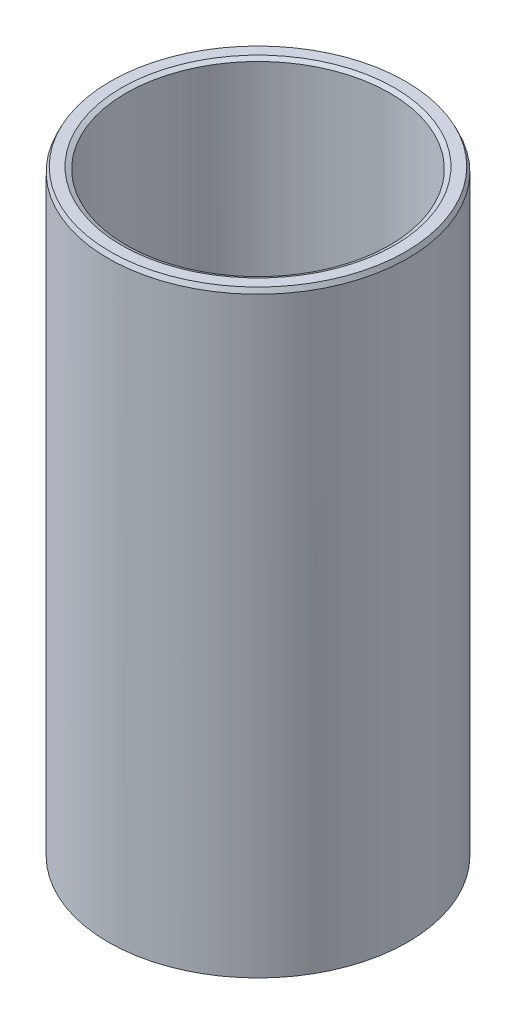
ISO-10303-21;
HEADER;
FILE_DESCRIPTION(('STEP AP214'),'2;1');
FILE_NAME('part.step','',(''),(''),'','','');
FILE_SCHEMA(('AUTOMOTIVE_DESIGN { 1 0 10303 214 1 1 1 1 }'));
ENDSEC;
DATA;
#1=APPLICATION_CONTEXT('core data for automotive mechanical design processes');
#2=APPLICATION_PROTOCOL_DEFINITION('international standard','automotive_design',2000,#1);
#3=PRODUCT_CONTEXT('',#1,'mechanical');
#4=PRODUCT('Part','Part','',(#3));
#5=PRODUCT_RELATED_PRODUCT_CATEGORY('part','',(#4));
#6=PRODUCT_DEFINITION_FORMATION('','',#4);
#7=PRODUCT_DEFINITION_CONTEXT('part definition',#1,'design');
#8=PRODUCT_DEFINITION('design','',#6,#7);
#9=PRODUCT_DEFINITION_SHAPE('','',#8);
#10=(LENGTH_UNIT() NAMED_UNIT(*) SI_UNIT(.MILLI.,.METRE.));
#11=(NAMED_UNIT(*) PLANE_ANGLE_UNIT() SI_UNIT($,.RADIAN.));
#12=(NAMED_UNIT(*) SI_UNIT($,.STERADIAN.) SOLID_ANGLE_UNIT());
#13=UNCERTAINTY_MEASURE_WITH_UNIT(LENGTH_MEASURE(1.E-05),#10,'distance_accuracy_value','');
#14=(GEOMETRIC_REPRESENTATION_CONTEXT(3) GLOBAL_UNCERTAINTY_ASSIGNED_CONTEXT((#13)) GLOBAL_UNIT_ASSIGNED_CONTEXT((#10,
#11,#12)) REPRESENTATION_CONTEXT('',''));
#15=CARTESIAN_POINT('',(0.,0.,0.));
#16=DIRECTION('',(0.,0.,1.));
#17=DIRECTION('',(1.,0.,0.));
#18=AXIS2_PLACEMENT_3D('',#15,#16,#17);
#19=CARTESIAN_POINT('',(0.,239.88289569676,0.));
#20=DIRECTION('',(0.,-1.,0.));
#21=DIRECTION('',(0.,0.,-1.));
#22=AXIS2_PLACEMENT_3D('',#19,#20,#21);
#23=CYLINDRICAL_SURFACE('',#22,60.);
#24=CARTESIAN_POINT('',(0.,0.880226060838596,0.));
#25=DIRECTION('',(0.,1.,0.));
#26=DIRECTION('',(0.,0.,1.));
#27=AXIS2_PLACEMENT_3D('',#24,#25,#26);
#28=CIRCLE('',#27,60.);
#29=CARTESIAN_POINT('',(0.,0.880226060838568,-60.));
#30=VERTEX_POINT('',#29);
#31=EDGE_CURVE('E10',#30,#30,#28,.T.);
#32=CARTESIAN_POINT('',(0.,238.010721630242,0.));
#33=DIRECTION('',(0.,1.,0.));
#34=DIRECTION('',(0.,0.,1.));
#35=AXIS2_PLACEMENT_3D('',#32,#33,#34);
#36=CIRCLE('',#35,60.);
#37=CARTESIAN_POINT('',(0.,238.010721630242,-60.));
#38=VERTEX_POINT('',#37);
#39=EDGE_CURVE('E50',#38,#38,#36,.F.);
#40=CARTESIAN_POINT('',(0.,0.880226060838568,-60.));
#41=CARTESIAN_POINT('',(0.,3.35033538968652,-60.));
#42=CARTESIAN_POINT('',(0.,5.82044471853446,-60.));
#43=CARTESIAN_POINT('',(0.,10.7606633762304,-60.));
#44=CARTESIAN_POINT('',(0.,13.2307727050783,-60.));
#45=CARTESIAN_POINT('',(0.,18.1709913627742,-60.));
#46=CARTESIAN_POINT('',(0.,20.6411006916221,-60.));
#47=CARTESIAN_POINT('',(0.,25.581319349318,-60.));
#48=CARTESIAN_POINT('',(0.,28.051428678166,-60.));
#49=CARTESIAN_POINT('',(0.,32.9916473358619,-60.));
#50=CARTESIAN_POINT('',(0.,35.4617566647099,-60.));
#51=CARTESIAN_POINT('',(0.,40.4019753224057,-60.));
#52=CARTESIAN_POINT('',(0.,42.8720846512537,-60.));
#53=CARTESIAN_POINT('',(0.,47.8123033089496,-60.));
#54=CARTESIAN_POINT('',(0.,50.2824126377975,-60.));
#55=CARTESIAN_POINT('',(0.,55.2226312954934,-60.));
#56=CARTESIAN_POINT('',(0.,57.6927406243414,-60.));
#57=CARTESIAN_POINT('',(0.,62.6329592820373,-60.));
#58=CARTESIAN_POINT('',(0.,65.1030686108852,-60.));
#59=CARTESIAN_POINT('',(0.,70.0432872685811,-60.));
#60=CARTESIAN_POINT('',(0.,72.5133965974291,-60.));
#61=CARTESIAN_POINT('',(0.,77.453615255125,-60.));
#62=CARTESIAN_POINT('',(0.,79.9237245839729,-60.));
#63=CARTESIAN_POINT('',(0.,84.8639432416688,-60.));
#64=CARTESIAN_POINT('',(0.,87.3340525705168,-60.));
#65=CARTESIAN_POINT('',(0.,92.2742712282127,-60.));
#66=CARTESIAN_POINT('',(0.,94.7443805570606,-60.));
#67=CARTESIAN_POINT('',(0.,99.6845992147565,-60.));
#68=CARTESIAN_POINT('',(0.,102.154708543604,-60.));
#69=CARTESIAN_POINT('',(0.,107.0949272013,-60.));
#70=CARTESIAN_POINT('',(0.,109.565036530148,-60.));
#71=CARTESIAN_POINT('',(0.,114.505255187844,-60.));
#72=CARTESIAN_POINT('',(0.,116.975364516692,-60.));
#73=CARTESIAN_POINT('',(0.,121.915583174388,-60.));
#74=CARTESIAN_POINT('',(0.,124.385692503236,-60.));
#75=CARTESIAN_POINT('',(0.,129.325911160932,-60.));
#76=CARTESIAN_POINT('',(0.,131.79602048978,-60.));
#77=CARTESIAN_POINT('',(0.,136.736239147476,-60.));
#78=CARTESIAN_POINT('',(0.,139.206348476324,-60.));
#79=CARTESIAN_POINT('',(0.,144.14656713402,-60.));
#80=CARTESIAN_POINT('',(0.,146.616676462868,-60.));
#81=CARTESIAN_POINT('',(0.,151.556895120563,-60.));
#82=CARTESIAN_POINT('',(0.,154.027004449411,-60.));
#83=CARTESIAN_POINT('',(0.,158.967223107107,-60.));
#84=CARTESIAN_POINT('',(0.,161.437332435955,-60.));
#85=CARTESIAN_POINT('',(0.,166.377551093651,-60.));
#86=CARTESIAN_POINT('',(0.,168.847660422499,-60.));
#87=CARTESIAN_POINT('',(0.,173.787879080195,-60.));
#88=CARTESIAN_POINT('',(0.,176.257988409043,-60.));
#89=CARTESIAN_POINT('',(0.,181.198207066739,-60.));
#90=CARTESIAN_POINT('',(0.,183.668316395587,-60.));
#91=CARTESIAN_POINT('',(0.,188.608535053283,-60.));
#92=CARTESIAN_POINT('',(0.,191.078644382131,-60.));
#93=CARTESIAN_POINT('',(0.,196.018863039826,-60.));
#94=CARTESIAN_POINT('',(0.,198.488972368674,-60.));
#95=CARTESIAN_POINT('',(0.,203.42919102637,-60.));
#96=CARTESIAN_POINT('',(0.,205.899300355218,-60.));
#97=CARTESIAN_POINT('',(0.,210.839519012914,-60.));
#98=CARTESIAN_POINT('',(0.,213.309628341762,-60.));
#99=CARTESIAN_POINT('',(0.,218.249846999458,-60.));
#100=CARTESIAN_POINT('',(0.,220.719956328306,-60.));
#101=CARTESIAN_POINT('',(0.,225.660174986002,-60.));
#102=CARTESIAN_POINT('',(0.,228.13028431485,-60.));
#103=CARTESIAN_POINT('',(0.,233.070502972546,-60.));
#104=CARTESIAN_POINT('',(0.,235.540612301394,-60.));
#105=CARTESIAN_POINT('',(0.,238.010721630242,-60.));
#106=B_SPLINE_CURVE_WITH_KNOTS('',3,(#40,#41,#42,#43,#44,#45,#46,#47,#48,#49,#50,#51,#52,#53,
#54,#55,#56,#57,#58,#59,#60,#61,#62,#63,#64,#65,#66,#67,#68,#69,#70,#71,#72,#73,#74,#75,#76,#77,
#78,#79,#80,#81,#82,#83,#84,#85,#86,#87,#88,#89,#90,#91,#92,#93,#94,#95,#96,#97,#98,#99,#100,
#101,#102,#103,#104,#105),.UNSPECIFIED.,.F.,.F.,(4,2,2,2,2,2,2,2,2,2,2,2,2,2,2,2,2,2,2,2,2,2,2,
2,2,2,2,2,2,2,2,2,4),(0.,7.41032798654384,14.8206559730877,22.2309839596315,29.6413119461754,
37.0516399327192,44.4619679192631,51.8722959058069,59.2826238923508,66.6929518788946,
74.1032798654385,81.5136078519823,88.9239358385261,96.33426382507,103.744591811614,
111.154919798158,118.565247784702,125.975575771245,133.385903757789,140.796231744333,
148.206559730877,155.616887717421,163.027215703965,170.437543690508,177.847871677052,
185.258199663596,192.66852765014,200.078855636684,207.489183623228,214.899511609772,
222.309839596315,229.720167582859,237.130495569403),.UNSPECIFIED.);
#107=EDGE_CURVE('BSEAM39',#30,#38,#106,.T.);
#108=ORIENTED_EDGE('',*,*,#31,.T.);
#109=ORIENTED_EDGE('',*,*,#39,.T.);
#110=ORIENTED_EDGE('',*,*,#107,.T.);
#111=ORIENTED_EDGE('',*,*,#107,.F.);
#112=EDGE_LOOP('',(#108,#110,#109,#111));
#113=FACE_BOUND('',#112,.T.);
#114=ADVANCED_FACE('F39',(#113),#23,.T.);
#115=CARTESIAN_POINT('',(0.,239.88289569676,0.));
#116=DIRECTION('',(0.,1.,0.));
#117=DIRECTION('',(0.,0.,1.));
#118=AXIS2_PLACEMENT_3D('',#115,#116,#117);
#119=PLANE('',#118);
#120=CARTESIAN_POINT('',(0.,239.88289569676,0.));
#121=DIRECTION('',(0.,1.,0.));
#122=DIRECTION('',(0.,0.,1.));
#123=AXIS2_PLACEMENT_3D('',#120,#121,#122);
#124=CIRCLE('',#123,54.6559119153576);
#125=CARTESIAN_POINT('',(0.,239.88289569676,54.6559119153576));
#126=VERTEX_POINT('',#125);
#127=EDGE_CURVE('E58',#126,#126,#124,.F.);
#128=ORIENTED_EDGE('',*,*,#127,.T.);
#129=EDGE_LOOP('',(#128));
#130=FACE_BOUND('',#129,.T.);
#131=CARTESIAN_POINT('',(0.,239.88289569676,0.));
#132=DIRECTION('',(0.,1.,0.));
#133=DIRECTION('',(0.,0.,1.));
#134=AXIS2_PLACEMENT_3D('',#131,#132,#133);
#135=CIRCLE('',#134,59.1197739391617);
#136=CARTESIAN_POINT('',(0.,239.88289569676,59.1197739391617));
#137=VERTEX_POINT('',#136);
#138=EDGE_CURVE('E61',#137,#137,#135,.T.);
#139=ORIENTED_EDGE('',*,*,#138,.T.);
#140=EDGE_LOOP('',(#139));
#141=FACE_BOUND('',#140,.T.);
#142=ADVANCED_FACE('F88',(#130,#141),#119,.T.);
#143=CARTESIAN_POINT('',(0.,0.,0.));
#144=DIRECTION('',(0.,1.,0.));
#145=DIRECTION('',(0.,0.,1.));
#146=AXIS2_PLACEMENT_3D('',#143,#144,#145);
#147=PLANE('',#146);
#148=CARTESIAN_POINT('',(0.,0.,0.));
#149=DIRECTION('',(0.,1.,0.));
#150=DIRECTION('',(0.,0.,1.));
#151=AXIS2_PLACEMENT_3D('',#148,#149,#150);
#152=CIRCLE('',#151,53.6639639096774);
#153=CARTESIAN_POINT('',(0.,0.,-53.6639639096774));
#154=VERTEX_POINT('',#153);
#155=EDGE_CURVE('E51',#154,#154,#152,.T.);
#156=ORIENTED_EDGE('',*,*,#155,.T.);
#157=EDGE_LOOP('',(#156));
#158=FACE_BOUND('',#157,.T.);
#159=CARTESIAN_POINT('',(0.,0.,0.));
#160=DIRECTION('',(0.,1.,0.));
#161=DIRECTION('',(0.,0.,1.));
#162=AXIS2_PLACEMENT_3D('',#159,#160,#161);
#163=CIRCLE('',#162,58.1278259334814);
#164=CARTESIAN_POINT('',(0.,0.,58.1278259334814));
#165=VERTEX_POINT('',#164);
#166=EDGE_CURVE('E54',#165,#165,#163,.F.);
#167=ORIENTED_EDGE('',*,*,#166,.T.);
#168=EDGE_LOOP('',(#167));
#169=FACE_BOUND('',#168,.T.);
#170=ADVANCED_FACE('F83',(#158,#169),#147,.F.);
#171=CARTESIAN_POINT('',(0.,239.88289569676,0.));
#172=DIRECTION('',(0.,-1.,0.));
#173=DIRECTION('',(0.,0.,-1.));
#174=AXIS2_PLACEMENT_3D('',#171,#172,#173);
#175=CYLINDRICAL_SURFACE('',#174,52.7837378488388);
#176=CARTESIAN_POINT('',(0.,239.002669635921,0.));
#177=DIRECTION('',(0.,1.,0.));
#178=DIRECTION('',(0.,0.,1.));
#179=AXIS2_PLACEMENT_3D('',#176,#177,#178);
#180=CIRCLE('',#179,52.7837378488388);
#181=CARTESIAN_POINT('',(0.,239.002669635921,-52.7837378488388));
#182=VERTEX_POINT('',#181);
#183=EDGE_CURVE('E67',#182,#182,#180,.T.);
#184=CARTESIAN_POINT('',(0.,1.87217406651852,0.));
#185=DIRECTION('',(0.,1.,0.));
#186=DIRECTION('',(0.,0.,1.));
#187=AXIS2_PLACEMENT_3D('',#184,#185,#186);
#188=CIRCLE('',#187,52.7837378488388);
#189=CARTESIAN_POINT('',(0.,1.87217406651849,-52.7837378488388));
#190=VERTEX_POINT('',#189);
#191=EDGE_CURVE('E69',#190,#190,#188,.F.);
#192=CARTESIAN_POINT('',(0.,239.002669635921,-52.7837378488388));
#193=CARTESIAN_POINT('',(0.,236.532560307073,-52.7837378488388));
#194=CARTESIAN_POINT('',(0.,234.062450978225,-52.7837378488388));
#195=CARTESIAN_POINT('',(0.,229.122232320529,-52.7837378488388));
#196=CARTESIAN_POINT('',(0.,226.652122991681,-52.7837378488388));
#197=CARTESIAN_POINT('',(0.,221.711904333985,-52.7837378488388));
#198=CARTESIAN_POINT('',(0.,219.241795005137,-52.7837378488388));
#199=CARTESIAN_POINT('',(0.,214.301576347441,-52.7837378488388));
#200=CARTESIAN_POINT('',(0.,211.831467018594,-52.7837378488388));
#201=CARTESIAN_POINT('',(0.,206.891248360898,-52.7837378488388));
#202=CARTESIAN_POINT('',(0.,204.42113903205,-52.7837378488388));
#203=CARTESIAN_POINT('',(0.,199.480920374354,-52.7837378488388));
#204=CARTESIAN_POINT('',(0.,197.010811045506,-52.7837378488388));
#205=CARTESIAN_POINT('',(0.,192.07059238781,-52.7837378488388));
#206=CARTESIAN_POINT('',(0.,189.600483058962,-52.7837378488388));
#207=CARTESIAN_POINT('',(0.,184.660264401266,-52.7837378488388));
#208=CARTESIAN_POINT('',(0.,182.190155072418,-52.7837378488388));
#209=CARTESIAN_POINT('',(0.,177.249936414722,-52.7837378488388));
#210=CARTESIAN_POINT('',(0.,174.779827085874,-52.7837378488388));
#211=CARTESIAN_POINT('',(0.,169.839608428179,-52.7837378488388));
#212=CARTESIAN_POINT('',(0.,167.369499099331,-52.7837378488388));
#213=CARTESIAN_POINT('',(0.,162.429280441635,-52.7837378488388));
#214=CARTESIAN_POINT('',(0.,159.959171112787,-52.7837378488388));
#215=CARTESIAN_POINT('',(0.,155.018952455091,-52.7837378488388));
#216=CARTESIAN_POINT('',(0.,152.548843126243,-52.7837378488388));
#217=CARTESIAN_POINT('',(0.,147.608624468547,-52.7837378488388));
#218=CARTESIAN_POINT('',(0.,145.138515139699,-52.7837378488388));
#219=CARTESIAN_POINT('',(0.,140.198296482003,-52.7837378488388));
#220=CARTESIAN_POINT('',(0.,137.728187153155,-52.7837378488388));
#221=CARTESIAN_POINT('',(0.,132.787968495459,-52.7837378488388));
#222=CARTESIAN_POINT('',(0.,130.317859166611,-52.7837378488388));
#223=CARTESIAN_POINT('',(0.,125.377640508916,-52.7837378488388));
#224=CARTESIAN_POINT('',(0.,122.907531180068,-52.7837378488388));
#225=CARTESIAN_POINT('',(0.,117.967312522372,-52.7837378488388));
#226=CARTESIAN_POINT('',(0.,115.497203193524,-52.7837378488388));
#227=CARTESIAN_POINT('',(0.,110.556984535828,-52.7837378488388));
#228=CARTESIAN_POINT('',(0.,108.08687520698,-52.7837378488388));
#229=CARTESIAN_POINT('',(0.,103.146656549284,-52.7837378488388));
#230=CARTESIAN_POINT('',(0.,100.676547220436,-52.7837378488388));
#231=CARTESIAN_POINT('',(0.,95.7363285627403,-52.7837378488388));
#232=CARTESIAN_POINT('',(0.,93.2662192338923,-52.7837378488388));
#233=CARTESIAN_POINT('',(0.,88.3260005761965,-52.7837378488388));
#234=CARTESIAN_POINT('',(0.,85.8558912473485,-52.7837378488388));
#235=CARTESIAN_POINT('',(0.,80.9156725896526,-52.7837378488388));
#236=CARTESIAN_POINT('',(0.,78.4455632608047,-52.7837378488388));
#237=CARTESIAN_POINT('',(0.,73.5053446031088,-52.7837378488388));
#238=CARTESIAN_POINT('',(0.,71.0352352742609,-52.7837378488388));
#239=CARTESIAN_POINT('',(0.,66.095016616565,-52.7837378488388));
#240=CARTESIAN_POINT('',(0.,63.624907287717,-52.7837378488388));
#241=CARTESIAN_POINT('',(0.,58.6846886300212,-52.7837378488388));
#242=CARTESIAN_POINT('',(0.,56.2145793011732,-52.7837378488388));
#243=CARTESIAN_POINT('',(0.,51.2743606434773,-52.7837378488388));
#244=CARTESIAN_POINT('',(0.,48.8042513146294,-52.7837378488388));
#245=CARTESIAN_POINT('',(0.,43.8640326569335,-52.7837378488388));
#246=CARTESIAN_POINT('',(0.,41.3939233280856,-52.7837378488388));
#247=CARTESIAN_POINT('',(0.,36.4537046703897,-52.7837378488388));
#248=CARTESIAN_POINT('',(0.,33.9835953415417,-52.7837378488388));
#249=CARTESIAN_POINT('',(0.,29.0433766838458,-52.7837378488388));
#250=CARTESIAN_POINT('',(0.,26.5732673549979,-52.7837378488388));
#251=CARTESIAN_POINT('',(0.,21.633048697302,-52.7837378488388));
#252=CARTESIAN_POINT('',(0.,19.1629393684541,-52.7837378488388));
#253=CARTESIAN_POINT('',(0.,14.2227207107582,-52.7837378488388));
#254=CARTESIAN_POINT('',(0.,11.7526113819102,-52.7837378488388));
#255=CARTESIAN_POINT('',(0.,6.81239272421436,-52.7837378488388));
#256=CARTESIAN_POINT('',(0.,4.34228339536643,-52.7837378488388));
#257=CARTESIAN_POINT('',(0.,1.87217406651849,-52.7837378488388));
#258=B_SPLINE_CURVE_WITH_KNOTS('',3,(#192,#193,#194,#195,#196,#197,#198,#199,#200,#201,#202,
#203,#204,#205,#206,#207,#208,#209,#210,#211,#212,#213,#214,#215,#216,#217,#218,#219,#220,#221,
#222,#223,#224,#225,#226,#227,#228,#229,#230,#231,#232,#233,#234,#235,#236,#237,#238,#239,#240,
#241,#242,#243,#244,#245,#246,#247,#248,#249,#250,#251,#252,#253,#254,#255,#256,#257),
.UNSPECIFIED.,.F.,.F.,(4,2,2,2,2,2,2,2,2,2,2,2,2,2,2,2,2,2,2,2,2,2,2,2,2,2,2,2,2,2,2,2,4),(0.,
7.41032798654381,14.8206559730876,22.2309839596315,29.6413119461753,37.0516399327191,
44.4619679192629,51.8722959058067,59.2826238923506,66.6929518788944,74.1032798654382,
81.5136078519821,88.9239358385259,96.3342638250697,103.744591811614,111.154919798157,
118.565247784701,125.975575771245,133.385903757789,140.796231744333,148.206559730876,
155.61688771742,163.027215703964,170.437543690508,177.847871677052,185.258199663596,
192.668527650139,200.078855636683,207.489183623227,214.899511609771,222.309839596315,
229.720167582859,237.130495569402),.UNSPECIFIED.);
#259=EDGE_CURVE('BSEAM71',#182,#190,#258,.T.);
#260=ORIENTED_EDGE('',*,*,#183,.T.);
#261=ORIENTED_EDGE('',*,*,#191,.T.);
#262=ORIENTED_EDGE('',*,*,#259,.T.);
#263=ORIENTED_EDGE('',*,*,#259,.F.);
#264=EDGE_LOOP('',(#260,#262,#261,#263));
#265=FACE_BOUND('',#264,.T.);
#266=ADVANCED_FACE('F71',(#265),#175,.F.);
#267=CARTESIAN_POINT('',(0.,239.002669635921,0.));
#268=DIRECTION('',(0.,1.,0.));
#269=DIRECTION('',(0.,0.,1.));
#270=AXIS2_PLACEMENT_3D('',#267,#268,#269);
#271=CONICAL_SURFACE('',#270,52.7837378488388,1.13130233999014);
#272=ORIENTED_EDGE('',*,*,#127,.F.);
#273=EDGE_LOOP('',(#272));
#274=FACE_BOUND('',#273,.T.);
#275=ORIENTED_EDGE('',*,*,#183,.F.);
#276=EDGE_LOOP('',(#275));
#277=FACE_BOUND('',#276,.T.);
#278=ADVANCED_FACE('F77',(#274,#277),#271,.F.);
#279=CARTESIAN_POINT('',(0.,0.,0.));
#280=DIRECTION('',(0.,-1.,0.));
#281=DIRECTION('',(0.,0.,-1.));
#282=AXIS2_PLACEMENT_3D('',#279,#280,#281);
#283=CONICAL_SURFACE('',#282,53.6639639096774,0.439493986804747);
#284=CARTESIAN_POINT('',(0.,1.87217406651852,-52.7837378488388));
#285=CARTESIAN_POINT('',(0.,1.85267225332561,-52.7929068703059));
#286=CARTESIAN_POINT('',(0.,1.83317044013271,-52.802075891773));
#287=CARTESIAN_POINT('',(0.,1.79416681374691,-52.8204139347071));
#288=CARTESIAN_POINT('',(0.,1.77466500055401,-52.8295829561742));
#289=CARTESIAN_POINT('',(0.,1.73566137416821,-52.8479209991083));
#290=CARTESIAN_POINT('',(0.,1.71615956097531,-52.8570900205754));
#291=CARTESIAN_POINT('',(0.,1.6771559345895,-52.8754280635095));
#292=CARTESIAN_POINT('',(0.,1.6576541213966,-52.8845970849766));
#293=CARTESIAN_POINT('',(0.,1.6186504950108,-52.9029351279107));
#294=CARTESIAN_POINT('',(0.,1.5991486818179,-52.9121041493778));
#295=CARTESIAN_POINT('',(0.,1.5601450554321,-52.9304421923119));
#296=CARTESIAN_POINT('',(0.,1.5406432422392,-52.939611213779));
#297=CARTESIAN_POINT('',(0.,1.50163961585339,-52.9579492567131));
#298=CARTESIAN_POINT('',(0.,1.48213780266049,-52.9671182781802));
#299=CARTESIAN_POINT('',(0.,1.44313417627469,-52.9854563211143));
#300=CARTESIAN_POINT('',(0.,1.42363236308179,-52.9946253425814));
#301=CARTESIAN_POINT('',(0.,1.38462873669599,-53.0129633855155));
#302=CARTESIAN_POINT('',(0.,1.36512692350309,-53.0221324069826));
#303=CARTESIAN_POINT('',(0.,1.32612329711728,-53.0404704499167));
#304=CARTESIAN_POINT('',(0.,1.30662148392438,-53.0496394713838));
#305=CARTESIAN_POINT('',(0.,1.26761785753858,-53.0679775143179));
#306=CARTESIAN_POINT('',(0.,1.24811604434568,-53.077146535785));
#307=CARTESIAN_POINT('',(0.,1.20911241795988,-53.0954845787191));
#308=CARTESIAN_POINT('',(0.,1.18961060476697,-53.1046536001862));
#309=CARTESIAN_POINT('',(0.,1.15060697838117,-53.1229916431204));
#310=CARTESIAN_POINT('',(0.,1.13110516518827,-53.1321606645874));
#311=CARTESIAN_POINT('',(0.,1.09210153880247,-53.1504987075215));
#312=CARTESIAN_POINT('',(0.,1.07259972560957,-53.1596677289886));
#313=CARTESIAN_POINT('',(0.,1.03359609922377,-53.1780057719228));
#314=CARTESIAN_POINT('',(0.,1.01409428603086,-53.1871747933898));
#315=CARTESIAN_POINT('',(0.,0.975090659645061,-53.205512836324));
#316=CARTESIAN_POINT('',(0.,0.955588846452159,-53.214681857791));
#317=CARTESIAN_POINT('',(0.,0.916585220066357,-53.2330199007252));
#318=CARTESIAN_POINT('',(0.,0.897083406873456,-53.2421889221922));
#319=CARTESIAN_POINT('',(0.,0.858079780487654,-53.2605269651264));
#320=CARTESIAN_POINT('',(0.,0.838577967294752,-53.2696959865934));
#321=CARTESIAN_POINT('',(0.,0.799574340908949,-53.2880340295276));
#322=CARTESIAN_POINT('',(0.,0.780072527716049,-53.2972030509947));
#323=CARTESIAN_POINT('',(0.,0.741068901330247,-53.3155410939288));
#324=CARTESIAN_POINT('',(0.,0.721567088137345,-53.3247101153959));
#325=CARTESIAN_POINT('',(0.,0.682563461751542,-53.34304815833));
#326=CARTESIAN_POINT('',(0.,0.663061648558642,-53.3522171797971));
#327=CARTESIAN_POINT('',(0.,0.62405802217284,-53.3705552227312));
#328=CARTESIAN_POINT('',(0.,0.604556208979938,-53.3797242441983));
#329=CARTESIAN_POINT('',(0.,0.565552582594135,-53.3980622871324));
#330=CARTESIAN_POINT('',(0.,0.546050769401233,-53.4072313085995));
#331=CARTESIAN_POINT('',(0.,0.507047143015431,-53.4255693515336));
#332=CARTESIAN_POINT('',(0.,0.487545329822531,-53.4347383730007));
#333=CARTESIAN_POINT('',(0.,0.448541703436728,-53.4530764159348));
#334=CARTESIAN_POINT('',(0.,0.429039890243826,-53.4622454374019));
#335=CARTESIAN_POINT('',(0.,0.390036263858024,-53.480583480336));
#336=CARTESIAN_POINT('',(0.,0.370534450665123,-53.4897525018031));
#337=CARTESIAN_POINT('',(0.,0.331530824279321,-53.5080905447372));
#338=CARTESIAN_POINT('',(0.,0.31202901108642,-53.5172595662043));
#339=CARTESIAN_POINT('',(0.,0.273025384700617,-53.5355976091384));
#340=CARTESIAN_POINT('',(0.,0.253523571507715,-53.5447666306055));
#341=CARTESIAN_POINT('',(0.,0.214519945121913,-53.5631046735396));
#342=CARTESIAN_POINT('',(0.,0.195018131929013,-53.5722736950067));
#343=CARTESIAN_POINT('',(0.,0.15601450554321,-53.5906117379408));
#344=CARTESIAN_POINT('',(0.,0.136512692350308,-53.5997807594079));
#345=CARTESIAN_POINT('',(0.,0.0975090659645055,-53.618118802342));
#346=CARTESIAN_POINT('',(0.,0.0780072527716048,-53.6272878238091));
#347=CARTESIAN_POINT('',(0.,0.0390036263858034,-53.6456258667433));
#348=CARTESIAN_POINT('',(0.,0.0195018131929027,-53.6547948882103));
#349=CARTESIAN_POINT('',(0.,0.,-53.6639639096774));
#350=B_SPLINE_CURVE_WITH_KNOTS('',3,(#284,#285,#286,#287,#288,#289,#290,#291,#292,#293,#294,
#295,#296,#297,#298,#299,#300,#301,#302,#303,#304,#305,#306,#307,#308,#309,#310,#311,#312,#313,
#314,#315,#316,#317,#318,#319,#320,#321,#322,#323,#324,#325,#326,#327,#328,#329,#330,#331,#332,
#333,#334,#335,#336,#337,#338,#339,#340,#341,#342,#343,#344,#345,#346,#347,#348,#349),
.UNSPECIFIED.,.F.,.F.,(4,2,2,2,2,2,2,2,2,2,2,2,2,2,2,2,2,2,2,2,2,2,2,2,2,2,2,2,2,2,2,2,4),(0.,
0.0646492463395302,0.129298492679063,0.193947739018593,0.258596985358127,0.323246231697657,
0.387895478037187,0.45254472437672,0.51719397071625,0.581843217055783,0.646492463395314,
0.711141709734844,0.775790956074377,0.840440202413907,0.90508944875344,0.96973869509297,
1.0343879414325,1.09903718777203,1.16368643411156,1.2283356804511,1.29298492679063,
1.35763417313016,1.42228341946969,1.48693266580922,1.55158191214875,1.61623115848828,
1.68088040482782,1.74552965116735,1.81017889750688,1.87482814384641,1.93947739018594,
2.00412663652547,2.068775882865),.UNSPECIFIED.);
#351=EDGE_CURVE('BSEAM73',#190,#154,#350,.T.);
#352=ORIENTED_EDGE('',*,*,#191,.F.);
#353=ORIENTED_EDGE('',*,*,#155,.F.);
#354=ORIENTED_EDGE('',*,*,#351,.T.);
#355=ORIENTED_EDGE('',*,*,#351,.F.);
#356=EDGE_LOOP('',(#352,#354,#353,#355));
#357=FACE_BOUND('',#356,.T.);
#358=ADVANCED_FACE('F73',(#357),#283,.F.);
#359=CARTESIAN_POINT('',(0.,0.880226060838596,0.));
#360=DIRECTION('',(0.,1.,0.));
#361=DIRECTION('',(0.,0.,1.));
#362=AXIS2_PLACEMENT_3D('',#359,#360,#361);
#363=CONICAL_SURFACE('',#362,60.,1.13130233999016);
#364=ORIENTED_EDGE('',*,*,#166,.F.);
#365=EDGE_LOOP('',(#364));
#366=FACE_BOUND('',#365,.T.);
#367=ORIENTED_EDGE('',*,*,#31,.F.);
#368=EDGE_LOOP('',(#367));
#369=FACE_BOUND('',#368,.T.);
#370=ADVANCED_FACE('F76',(#366,#369),#363,.T.);
#371=CARTESIAN_POINT('',(0.,239.88289569676,0.));
#372=DIRECTION('',(0.,-1.,0.));
#373=DIRECTION('',(0.,0.,-1.));
#374=AXIS2_PLACEMENT_3D('',#371,#372,#373);
#375=CONICAL_SURFACE('',#374,59.1197739391617,0.439493986804722);
#376=ORIENTED_EDGE('',*,*,#39,.F.);
#377=EDGE_LOOP('',(#376));
#378=FACE_BOUND('',#377,.T.);
#379=ORIENTED_EDGE('',*,*,#138,.F.);
#380=EDGE_LOOP('',(#379));
#381=FACE_BOUND('',#380,.T.);
#382=ADVANCED_FACE('F45',(#378,#381),#375,.T.);
#383=CLOSED_SHELL('',(#114,#142,#170,#266,#278,#358,#370,#382));
#384=MANIFOLD_SOLID_BREP('B2',#383);
#385=ADVANCED_BREP_SHAPE_REPRESENTATION('',(#18,#384),#14);
#386=SHAPE_DEFINITION_REPRESENTATION(#9,#385);
ENDSEC;
END-ISO-10303-21;
